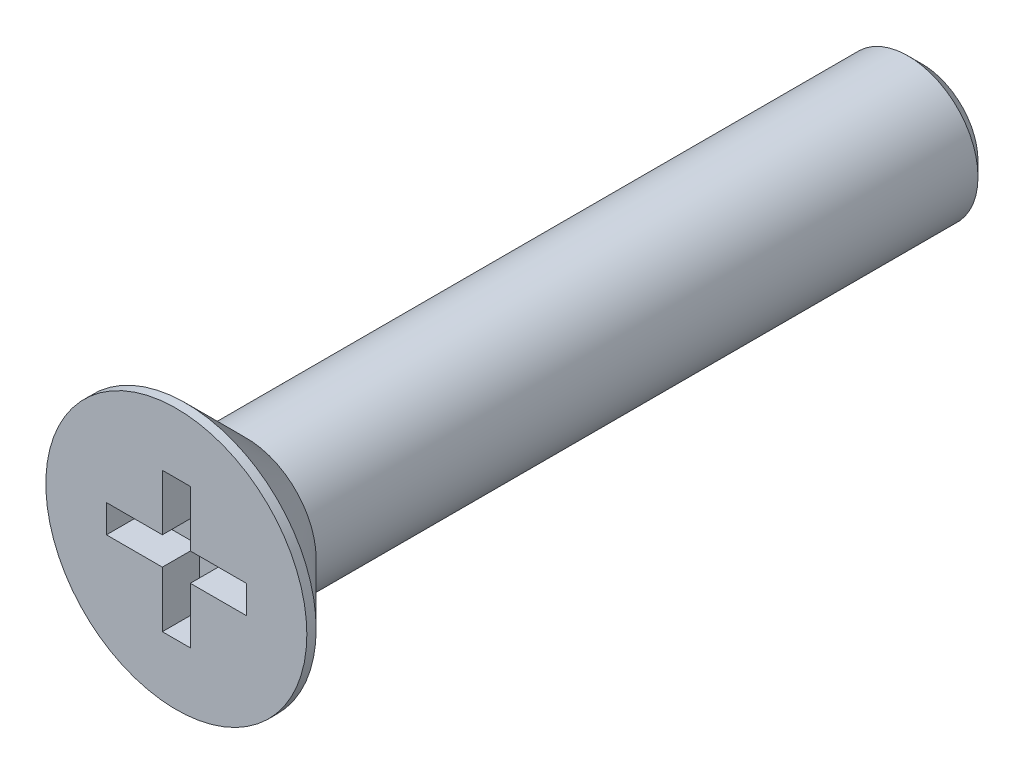
ISO-10303-21;
HEADER;
FILE_DESCRIPTION(('STEP AP214'),'2;1');
FILE_NAME('part.step','',(''),(''),'','','');
FILE_SCHEMA(('AUTOMOTIVE_DESIGN { 1 0 10303 214 1 1 1 1 }'));
ENDSEC;
DATA;
#1=APPLICATION_CONTEXT('core data for automotive mechanical design processes');
#2=APPLICATION_PROTOCOL_DEFINITION('international standard','automotive_design',2000,#1);
#3=PRODUCT_CONTEXT('',#1,'mechanical');
#4=PRODUCT('Part','Part','',(#3));
#5=PRODUCT_RELATED_PRODUCT_CATEGORY('part','',(#4));
#6=PRODUCT_DEFINITION_FORMATION('','',#4);
#7=PRODUCT_DEFINITION_CONTEXT('part definition',#1,'design');
#8=PRODUCT_DEFINITION('design','',#6,#7);
#9=PRODUCT_DEFINITION_SHAPE('','',#8);
#10=(LENGTH_UNIT() NAMED_UNIT(*) SI_UNIT(.MILLI.,.METRE.));
#11=(NAMED_UNIT(*) PLANE_ANGLE_UNIT() SI_UNIT($,.RADIAN.));
#12=(NAMED_UNIT(*) SI_UNIT($,.STERADIAN.) SOLID_ANGLE_UNIT());
#13=UNCERTAINTY_MEASURE_WITH_UNIT(LENGTH_MEASURE(1.E-05),#10,'distance_accuracy_value','');
#14=(GEOMETRIC_REPRESENTATION_CONTEXT(3) GLOBAL_UNCERTAINTY_ASSIGNED_CONTEXT((#13)) GLOBAL_UNIT_ASSIGNED_CONTEXT((#10,
#11,#12)) REPRESENTATION_CONTEXT('',''));
#15=CARTESIAN_POINT('',(0.,0.,0.));
#16=DIRECTION('',(0.,0.,1.));
#17=DIRECTION('',(1.,0.,0.));
#18=AXIS2_PLACEMENT_3D('',#15,#16,#17);
#19=CARTESIAN_POINT('',(0.,0.,0.));
#20=DIRECTION('',(0.,0.,-1.));
#21=DIRECTION('',(-1.,0.,0.));
#22=AXIS2_PLACEMENT_3D('',#19,#20,#21);
#23=PLANE('',#22);
#24=DIRECTION('',(0.,-1.,0.));
#25=VECTOR('',#24,1.);
#26=CARTESIAN_POINT('',(-1.5,-0.3,0.));
#27=LINE('',#26,#25);
#28=CARTESIAN_POINT('',(-1.5,0.3,0.));
#29=VERTEX_POINT('',#28);
#30=CARTESIAN_POINT('',(-1.5,-0.3,0.));
#31=VERTEX_POINT('',#30);
#32=EDGE_CURVE('E161',#29,#31,#27,.T.);
#33=ORIENTED_EDGE('',*,*,#32,.F.);
#34=DIRECTION('',(-1.,0.,0.));
#35=VECTOR('',#34,1.);
#36=CARTESIAN_POINT('',(-1.5,0.3,0.));
#37=LINE('',#36,#35);
#38=CARTESIAN_POINT('',(-0.3,0.3,0.));
#39=VERTEX_POINT('',#38);
#40=EDGE_CURVE('E51',#39,#29,#37,.T.);
#41=ORIENTED_EDGE('',*,*,#40,.F.);
#42=DIRECTION('',(0.,-1.,0.));
#43=VECTOR('',#42,1.);
#44=CARTESIAN_POINT('',(-0.3,0.3,0.));
#45=LINE('',#44,#43);
#46=CARTESIAN_POINT('',(-0.3,1.5,0.));
#47=VERTEX_POINT('',#46);
#48=EDGE_CURVE('E188',#47,#39,#45,.T.);
#49=ORIENTED_EDGE('',*,*,#48,.F.);
#50=DIRECTION('',(-1.,0.,0.));
#51=VECTOR('',#50,1.);
#52=CARTESIAN_POINT('',(-0.3,1.5,0.));
#53=LINE('',#52,#51);
#54=CARTESIAN_POINT('',(0.3,1.5,0.));
#55=VERTEX_POINT('',#54);
#56=EDGE_CURVE('E186',#55,#47,#53,.T.);
#57=ORIENTED_EDGE('',*,*,#56,.F.);
#58=DIRECTION('',(0.,1.,0.));
#59=VECTOR('',#58,1.);
#60=CARTESIAN_POINT('',(0.3,0.3,0.));
#61=LINE('',#60,#59);
#62=CARTESIAN_POINT('',(0.3,0.3,0.));
#63=VERTEX_POINT('',#62);
#64=EDGE_CURVE('E135',#63,#55,#61,.T.);
#65=ORIENTED_EDGE('',*,*,#64,.F.);
#66=DIRECTION('',(-1.,0.,0.));
#67=VECTOR('',#66,1.);
#68=CARTESIAN_POINT('',(1.5,0.3,0.));
#69=LINE('',#68,#67);
#70=CARTESIAN_POINT('',(1.5,0.3,0.));
#71=VERTEX_POINT('',#70);
#72=EDGE_CURVE('E182',#71,#63,#69,.T.);
#73=ORIENTED_EDGE('',*,*,#72,.F.);
#74=DIRECTION('',(0.,1.,0.));
#75=VECTOR('',#74,1.);
#76=CARTESIAN_POINT('',(1.5,-0.3,0.));
#77=LINE('',#76,#75);
#78=CARTESIAN_POINT('',(1.5,-0.3,0.));
#79=VERTEX_POINT('',#78);
#80=EDGE_CURVE('E179',#79,#71,#77,.T.);
#81=ORIENTED_EDGE('',*,*,#80,.F.);
#82=DIRECTION('',(1.,0.,0.));
#83=VECTOR('',#82,1.);
#84=CARTESIAN_POINT('',(1.5,-0.3,0.));
#85=LINE('',#84,#83);
#86=CARTESIAN_POINT('',(0.3,-0.3,0.));
#87=VERTEX_POINT('',#86);
#88=EDGE_CURVE('E176',#87,#79,#85,.T.);
#89=ORIENTED_EDGE('',*,*,#88,.F.);
#90=DIRECTION('',(0.,1.,0.));
#91=VECTOR('',#90,1.);
#92=CARTESIAN_POINT('',(0.3,-0.3,0.));
#93=LINE('',#92,#91);
#94=CARTESIAN_POINT('',(0.3,-1.5,0.));
#95=VERTEX_POINT('',#94);
#96=EDGE_CURVE('E173',#95,#87,#93,.T.);
#97=ORIENTED_EDGE('',*,*,#96,.F.);
#98=DIRECTION('',(1.,0.,0.));
#99=VECTOR('',#98,1.);
#100=CARTESIAN_POINT('',(-0.299999999999999,-1.5,0.));
#101=LINE('',#100,#99);
#102=CARTESIAN_POINT('',(-0.299999999999999,-1.5,0.));
#103=VERTEX_POINT('',#102);
#104=EDGE_CURVE('E170',#103,#95,#101,.T.);
#105=ORIENTED_EDGE('',*,*,#104,.F.);
#106=DIRECTION('',(0.,-1.,0.));
#107=VECTOR('',#106,1.);
#108=CARTESIAN_POINT('',(-0.3,-0.3,0.));
#109=LINE('',#108,#107);
#110=CARTESIAN_POINT('',(-0.3,-0.3,0.));
#111=VERTEX_POINT('',#110);
#112=EDGE_CURVE('E167',#111,#103,#109,.T.);
#113=ORIENTED_EDGE('',*,*,#112,.F.);
#114=DIRECTION('',(1.,0.,0.));
#115=VECTOR('',#114,1.);
#116=CARTESIAN_POINT('',(-1.5,-0.3,0.));
#117=LINE('',#116,#115);
#118=EDGE_CURVE('E164',#31,#111,#117,.T.);
#119=ORIENTED_EDGE('',*,*,#118,.F.);
#120=EDGE_LOOP('',(#33,#41,#49,#57,#65,#73,#81,#89,#97,#105,#113,#119));
#121=FACE_BOUND('',#120,.T.);
#122=CARTESIAN_POINT('',(0.,0.,0.));
#123=DIRECTION('',(0.,0.,1.));
#124=DIRECTION('',(1.,0.,0.));
#125=AXIS2_PLACEMENT_3D('',#122,#123,#124);
#126=CIRCLE('',#125,2.8);
#127=CARTESIAN_POINT('',(2.8,0.,0.));
#128=VERTEX_POINT('',#127);
#129=EDGE_CURVE('E215',#128,#128,#126,.T.);
#130=ORIENTED_EDGE('',*,*,#129,.T.);
#131=EDGE_LOOP('',(#130));
#132=FACE_BOUND('',#131,.T.);
#133=ADVANCED_FACE('F36',(#121,#132),#23,.F.);
#134=CARTESIAN_POINT('',(0.,0.,31.7635815070186));
#135=DIRECTION('',(0.,0.,1.));
#136=DIRECTION('',(1.,0.,0.));
#137=AXIS2_PLACEMENT_3D('',#134,#135,#136);
#138=CYLINDRICAL_SURFACE('',#137,2.8);
#139=ORIENTED_EDGE('',*,*,#129,.F.);
#140=EDGE_LOOP('',(#139));
#141=FACE_BOUND('',#140,.T.);
#142=CARTESIAN_POINT('',(0.,0.,-0.200000000000006));
#143=DIRECTION('',(0.,0.,1.));
#144=DIRECTION('',(1.,0.,0.));
#145=AXIS2_PLACEMENT_3D('',#142,#143,#144);
#146=CIRCLE('',#145,2.8);
#147=CARTESIAN_POINT('',(2.8,0.,-0.200000000000006));
#148=VERTEX_POINT('',#147);
#149=EDGE_CURVE('E212',#148,#148,#146,.T.);
#150=ORIENTED_EDGE('',*,*,#149,.T.);
#151=EDGE_LOOP('',(#150));
#152=FACE_BOUND('',#151,.T.);
#153=ADVANCED_FACE('F232',(#141,#152),#138,.T.);
#154=CARTESIAN_POINT('',(0.,0.,-1.5));
#155=DIRECTION('',(0.,0.,1.));
#156=DIRECTION('',(1.,0.,0.));
#157=AXIS2_PLACEMENT_3D('',#154,#155,#156);
#158=CONICAL_SURFACE('',#157,1.5,0.78539816339745);
#159=ORIENTED_EDGE('',*,*,#149,.F.);
#160=EDGE_LOOP('',(#159));
#161=FACE_BOUND('',#160,.T.);
#162=CARTESIAN_POINT('',(0.,0.,-1.5));
#163=DIRECTION('',(0.,0.,1.));
#164=DIRECTION('',(1.,0.,0.));
#165=AXIS2_PLACEMENT_3D('',#162,#163,#164);
#166=CIRCLE('',#165,1.5);
#167=CARTESIAN_POINT('',(1.5,0.,-1.5));
#168=VERTEX_POINT('',#167);
#169=EDGE_CURVE('E192',#168,#168,#166,.T.);
#170=ORIENTED_EDGE('',*,*,#169,.T.);
#171=EDGE_LOOP('',(#170));
#172=FACE_BOUND('',#171,.T.);
#173=ADVANCED_FACE('F237',(#161,#172),#158,.T.);
#174=CARTESIAN_POINT('',(0.,0.,31.7635815070186));
#175=DIRECTION('',(0.,0.,1.));
#176=DIRECTION('',(1.,0.,0.));
#177=AXIS2_PLACEMENT_3D('',#174,#175,#176);
#178=CYLINDRICAL_SURFACE('',#177,1.5);
#179=CARTESIAN_POINT('',(0.,0.,-15.7));
#180=DIRECTION('',(0.,0.,1.));
#181=DIRECTION('',(1.,0.,0.));
#182=AXIS2_PLACEMENT_3D('',#179,#180,#181);
#183=CIRCLE('',#182,1.5);
#184=CARTESIAN_POINT('',(1.5,0.,-15.7));
#185=VERTEX_POINT('',#184);
#186=EDGE_CURVE('E44',#185,#185,#183,.T.);
#187=ORIENTED_EDGE('',*,*,#186,.T.);
#188=EDGE_LOOP('',(#187));
#189=FACE_BOUND('',#188,.T.);
#190=ORIENTED_EDGE('',*,*,#169,.F.);
#191=EDGE_LOOP('',(#190));
#192=FACE_BOUND('',#191,.T.);
#193=ADVANCED_FACE('F220',(#189,#192),#178,.T.);
#194=CARTESIAN_POINT('',(0.,1.5,-16.));
#195=DIRECTION('',(0.,0.,1.));
#196=DIRECTION('',(1.,0.,0.));
#197=AXIS2_PLACEMENT_3D('',#194,#195,#196);
#198=PLANE('',#197);
#199=CARTESIAN_POINT('',(0.,0.,-16.));
#200=DIRECTION('',(0.,0.,1.));
#201=DIRECTION('',(1.,0.,0.));
#202=AXIS2_PLACEMENT_3D('',#199,#200,#201);
#203=CIRCLE('',#202,1.2);
#204=CARTESIAN_POINT('',(1.2,0.,-16.));
#205=VERTEX_POINT('',#204);
#206=EDGE_CURVE('E11',#205,#205,#203,.F.);
#207=ORIENTED_EDGE('',*,*,#206,.T.);
#208=EDGE_LOOP('',(#207));
#209=FACE_BOUND('',#208,.T.);
#210=ADVANCED_FACE('F248',(#209),#198,.F.);
#211=CARTESIAN_POINT('',(-1.5,0.3,-0.8));
#212=DIRECTION('',(0.,1.,0.));
#213=DIRECTION('',(-1.,0.,0.));
#214=AXIS2_PLACEMENT_3D('',#211,#212,#213);
#215=PLANE('',#214);
#216=ORIENTED_EDGE('',*,*,#40,.T.);
#217=DIRECTION('',(0.,0.,1.));
#218=VECTOR('',#217,1.);
#219=CARTESIAN_POINT('',(-1.5,0.3,-0.8));
#220=LINE('',#219,#218);
#221=CARTESIAN_POINT('',(-1.5,0.3,-0.8));
#222=VERTEX_POINT('',#221);
#223=EDGE_CURVE('E99',#222,#29,#220,.T.);
#224=ORIENTED_EDGE('',*,*,#223,.F.);
#225=DIRECTION('',(-1.,0.,0.));
#226=VECTOR('',#225,1.);
#227=CARTESIAN_POINT('',(-1.5,0.3,-0.8));
#228=LINE('',#227,#226);
#229=CARTESIAN_POINT('',(-0.3,0.3,-0.8));
#230=VERTEX_POINT('',#229);
#231=EDGE_CURVE('E190',#230,#222,#228,.T.);
#232=ORIENTED_EDGE('',*,*,#231,.F.);
#233=DIRECTION('',(0.,0.,1.));
#234=VECTOR('',#233,1.);
#235=CARTESIAN_POINT('',(-0.3,0.3,-0.8));
#236=LINE('',#235,#234);
#237=EDGE_CURVE('E59',#230,#39,#236,.T.);
#238=ORIENTED_EDGE('',*,*,#237,.T.);
#239=EDGE_LOOP('',(#216,#224,#232,#238));
#240=FACE_BOUND('',#239,.T.);
#241=ADVANCED_FACE('F251',(#240),#215,.F.);
#242=CARTESIAN_POINT('',(-0.3,0.3,-0.8));
#243=DIRECTION('',(-1.,0.,0.));
#244=DIRECTION('',(0.,-1.,0.));
#245=AXIS2_PLACEMENT_3D('',#242,#243,#244);
#246=PLANE('',#245);
#247=ORIENTED_EDGE('',*,*,#48,.T.);
#248=ORIENTED_EDGE('',*,*,#237,.F.);
#249=DIRECTION('',(0.,-1.,0.));
#250=VECTOR('',#249,1.);
#251=CARTESIAN_POINT('',(-0.3,0.3,-0.8));
#252=LINE('',#251,#250);
#253=CARTESIAN_POINT('',(-0.3,1.5,-0.8));
#254=VERTEX_POINT('',#253);
#255=EDGE_CURVE('E147',#254,#230,#252,.T.);
#256=ORIENTED_EDGE('',*,*,#255,.F.);
#257=DIRECTION('',(0.,0.,1.));
#258=VECTOR('',#257,1.);
#259=CARTESIAN_POINT('',(-0.3,1.5,-0.8));
#260=LINE('',#259,#258);
#261=EDGE_CURVE('E139',#254,#47,#260,.T.);
#262=ORIENTED_EDGE('',*,*,#261,.T.);
#263=EDGE_LOOP('',(#247,#248,#256,#262));
#264=FACE_BOUND('',#263,.T.);
#265=ADVANCED_FACE('F255',(#264),#246,.F.);
#266=CARTESIAN_POINT('',(-0.3,1.5,-0.8));
#267=DIRECTION('',(0.,1.,0.));
#268=DIRECTION('',(0.,0.,1.));
#269=AXIS2_PLACEMENT_3D('',#266,#267,#268);
#270=PLANE('',#269);
#271=ORIENTED_EDGE('',*,*,#56,.T.);
#272=ORIENTED_EDGE('',*,*,#261,.F.);
#273=DIRECTION('',(-1.,0.,0.));
#274=VECTOR('',#273,1.);
#275=CARTESIAN_POINT('',(-0.3,1.5,-0.8));
#276=LINE('',#275,#274);
#277=CARTESIAN_POINT('',(0.3,1.5,-0.8));
#278=VERTEX_POINT('',#277);
#279=EDGE_CURVE('E143',#278,#254,#276,.T.);
#280=ORIENTED_EDGE('',*,*,#279,.F.);
#281=DIRECTION('',(0.,0.,1.));
#282=VECTOR('',#281,1.);
#283=CARTESIAN_POINT('',(0.3,1.5,-0.8));
#284=LINE('',#283,#282);
#285=EDGE_CURVE('E128',#278,#55,#284,.T.);
#286=ORIENTED_EDGE('',*,*,#285,.T.);
#287=EDGE_LOOP('',(#271,#272,#280,#286));
#288=FACE_BOUND('',#287,.T.);
#289=ADVANCED_FACE('F144',(#288),#270,.F.);
#290=CARTESIAN_POINT('',(0.3,0.3,-0.8));
#291=DIRECTION('',(1.,0.,0.));
#292=DIRECTION('',(0.,1.,0.));
#293=AXIS2_PLACEMENT_3D('',#290,#291,#292);
#294=PLANE('',#293);
#295=ORIENTED_EDGE('',*,*,#64,.T.);
#296=ORIENTED_EDGE('',*,*,#285,.F.);
#297=DIRECTION('',(0.,1.,0.));
#298=VECTOR('',#297,1.);
#299=CARTESIAN_POINT('',(0.3,0.3,-0.8));
#300=LINE('',#299,#298);
#301=CARTESIAN_POINT('',(0.3,0.3,-0.8));
#302=VERTEX_POINT('',#301);
#303=EDGE_CURVE('E132',#302,#278,#300,.T.);
#304=ORIENTED_EDGE('',*,*,#303,.F.);
#305=DIRECTION('',(0.,0.,1.));
#306=VECTOR('',#305,1.);
#307=CARTESIAN_POINT('',(0.3,0.3,-0.8));
#308=LINE('',#307,#306);
#309=EDGE_CURVE('E140',#302,#63,#308,.T.);
#310=ORIENTED_EDGE('',*,*,#309,.T.);
#311=EDGE_LOOP('',(#295,#296,#304,#310));
#312=FACE_BOUND('',#311,.T.);
#313=ADVANCED_FACE('F130',(#312),#294,.F.);
#314=CARTESIAN_POINT('',(1.5,0.3,-0.8));
#315=DIRECTION('',(0.,1.,0.));
#316=DIRECTION('',(-1.,0.,0.));
#317=AXIS2_PLACEMENT_3D('',#314,#315,#316);
#318=PLANE('',#317);
#319=ORIENTED_EDGE('',*,*,#72,.T.);
#320=ORIENTED_EDGE('',*,*,#309,.F.);
#321=DIRECTION('',(-1.,0.,0.));
#322=VECTOR('',#321,1.);
#323=CARTESIAN_POINT('',(1.5,0.3,-0.8));
#324=LINE('',#323,#322);
#325=CARTESIAN_POINT('',(1.5,0.3,-0.8));
#326=VERTEX_POINT('',#325);
#327=EDGE_CURVE('E153',#326,#302,#324,.T.);
#328=ORIENTED_EDGE('',*,*,#327,.F.);
#329=DIRECTION('',(0.,0.,1.));
#330=VECTOR('',#329,1.);
#331=CARTESIAN_POINT('',(1.5,0.3,-0.8));
#332=LINE('',#331,#330);
#333=EDGE_CURVE('E195',#326,#71,#332,.T.);
#334=ORIENTED_EDGE('',*,*,#333,.T.);
#335=EDGE_LOOP('',(#319,#320,#328,#334));
#336=FACE_BOUND('',#335,.T.);
#337=ADVANCED_FACE('F282',(#336),#318,.F.);
#338=CARTESIAN_POINT('',(1.5,-0.3,-0.8));
#339=DIRECTION('',(1.,0.,0.));
#340=DIRECTION('',(0.,0.,-1.));
#341=AXIS2_PLACEMENT_3D('',#338,#339,#340);
#342=PLANE('',#341);
#343=ORIENTED_EDGE('',*,*,#80,.T.);
#344=ORIENTED_EDGE('',*,*,#333,.F.);
#345=DIRECTION('',(0.,1.,0.));
#346=VECTOR('',#345,1.);
#347=CARTESIAN_POINT('',(1.5,-0.3,-0.8));
#348=LINE('',#347,#346);
#349=CARTESIAN_POINT('',(1.5,-0.3,-0.8));
#350=VERTEX_POINT('',#349);
#351=EDGE_CURVE('E155',#350,#326,#348,.T.);
#352=ORIENTED_EDGE('',*,*,#351,.F.);
#353=DIRECTION('',(0.,0.,1.));
#354=VECTOR('',#353,1.);
#355=CARTESIAN_POINT('',(1.5,-0.3,-0.8));
#356=LINE('',#355,#354);
#357=EDGE_CURVE('E197',#350,#79,#356,.T.);
#358=ORIENTED_EDGE('',*,*,#357,.T.);
#359=EDGE_LOOP('',(#343,#344,#352,#358));
#360=FACE_BOUND('',#359,.T.);
#361=ADVANCED_FACE('F278',(#360),#342,.F.);
#362=CARTESIAN_POINT('',(1.5,-0.3,-0.8));
#363=DIRECTION('',(0.,-1.,0.));
#364=DIRECTION('',(1.,0.,0.));
#365=AXIS2_PLACEMENT_3D('',#362,#363,#364);
#366=PLANE('',#365);
#367=ORIENTED_EDGE('',*,*,#88,.T.);
#368=ORIENTED_EDGE('',*,*,#357,.F.);
#369=DIRECTION('',(1.,0.,0.));
#370=VECTOR('',#369,1.);
#371=CARTESIAN_POINT('',(1.5,-0.3,-0.8));
#372=LINE('',#371,#370);
#373=CARTESIAN_POINT('',(0.3,-0.3,-0.8));
#374=VERTEX_POINT('',#373);
#375=EDGE_CURVE('E315',#374,#350,#372,.T.);
#376=ORIENTED_EDGE('',*,*,#375,.F.);
#377=DIRECTION('',(0.,0.,1.));
#378=VECTOR('',#377,1.);
#379=CARTESIAN_POINT('',(0.3,-0.3,-0.8));
#380=LINE('',#379,#378);
#381=EDGE_CURVE('E199',#374,#87,#380,.T.);
#382=ORIENTED_EDGE('',*,*,#381,.T.);
#383=EDGE_LOOP('',(#367,#368,#376,#382));
#384=FACE_BOUND('',#383,.T.);
#385=ADVANCED_FACE('F274',(#384),#366,.F.);
#386=CARTESIAN_POINT('',(0.3,-0.3,-0.8));
#387=DIRECTION('',(1.,0.,0.));
#388=DIRECTION('',(0.,1.,0.));
#389=AXIS2_PLACEMENT_3D('',#386,#387,#388);
#390=PLANE('',#389);
#391=ORIENTED_EDGE('',*,*,#96,.T.);
#392=ORIENTED_EDGE('',*,*,#381,.F.);
#393=DIRECTION('',(0.,1.,0.));
#394=VECTOR('',#393,1.);
#395=CARTESIAN_POINT('',(0.3,-0.3,-0.8));
#396=LINE('',#395,#394);
#397=CARTESIAN_POINT('',(0.3,-1.5,-0.8));
#398=VERTEX_POINT('',#397);
#399=EDGE_CURVE('E312',#398,#374,#396,.T.);
#400=ORIENTED_EDGE('',*,*,#399,.F.);
#401=DIRECTION('',(0.,0.,1.));
#402=VECTOR('',#401,1.);
#403=CARTESIAN_POINT('',(0.3,-1.5,-0.8));
#404=LINE('',#403,#402);
#405=EDGE_CURVE('E201',#398,#95,#404,.T.);
#406=ORIENTED_EDGE('',*,*,#405,.T.);
#407=EDGE_LOOP('',(#391,#392,#400,#406));
#408=FACE_BOUND('',#407,.T.);
#409=ADVANCED_FACE('F270',(#408),#390,.F.);
#410=CARTESIAN_POINT('',(-0.299999999999999,-1.5,-0.8));
#411=DIRECTION('',(0.,-1.,0.));
#412=DIRECTION('',(0.,0.,-1.));
#413=AXIS2_PLACEMENT_3D('',#410,#411,#412);
#414=PLANE('',#413);
#415=ORIENTED_EDGE('',*,*,#104,.T.);
#416=ORIENTED_EDGE('',*,*,#405,.F.);
#417=DIRECTION('',(1.,0.,0.));
#418=VECTOR('',#417,1.);
#419=CARTESIAN_POINT('',(-0.299999999999999,-1.5,-0.8));
#420=LINE('',#419,#418);
#421=CARTESIAN_POINT('',(-0.299999999999999,-1.5,-0.8));
#422=VERTEX_POINT('',#421);
#423=EDGE_CURVE('E309',#422,#398,#420,.T.);
#424=ORIENTED_EDGE('',*,*,#423,.F.);
#425=DIRECTION('',(0.,0.,1.));
#426=VECTOR('',#425,1.);
#427=CARTESIAN_POINT('',(-0.299999999999999,-1.5,-0.8));
#428=LINE('',#427,#426);
#429=EDGE_CURVE('E203',#422,#103,#428,.T.);
#430=ORIENTED_EDGE('',*,*,#429,.T.);
#431=EDGE_LOOP('',(#415,#416,#424,#430));
#432=FACE_BOUND('',#431,.T.);
#433=ADVANCED_FACE('F266',(#432),#414,.F.);
#434=CARTESIAN_POINT('',(-0.3,-0.3,-0.8));
#435=DIRECTION('',(-1.,0.,0.));
#436=DIRECTION('',(0.,-1.,0.));
#437=AXIS2_PLACEMENT_3D('',#434,#435,#436);
#438=PLANE('',#437);
#439=ORIENTED_EDGE('',*,*,#112,.T.);
#440=ORIENTED_EDGE('',*,*,#429,.F.);
#441=DIRECTION('',(0.,-1.,0.));
#442=VECTOR('',#441,1.);
#443=CARTESIAN_POINT('',(-0.3,-0.3,-0.8));
#444=LINE('',#443,#442);
#445=CARTESIAN_POINT('',(-0.3,-0.3,-0.8));
#446=VERTEX_POINT('',#445);
#447=EDGE_CURVE('E306',#446,#422,#444,.T.);
#448=ORIENTED_EDGE('',*,*,#447,.F.);
#449=DIRECTION('',(0.,0.,1.));
#450=VECTOR('',#449,1.);
#451=CARTESIAN_POINT('',(-0.3,-0.3,-0.8));
#452=LINE('',#451,#450);
#453=EDGE_CURVE('E205',#446,#111,#452,.T.);
#454=ORIENTED_EDGE('',*,*,#453,.T.);
#455=EDGE_LOOP('',(#439,#440,#448,#454));
#456=FACE_BOUND('',#455,.T.);
#457=ADVANCED_FACE('F262',(#456),#438,.F.);
#458=CARTESIAN_POINT('',(-1.5,-0.3,-0.8));
#459=DIRECTION('',(0.,-1.,0.));
#460=DIRECTION('',(1.,0.,0.));
#461=AXIS2_PLACEMENT_3D('',#458,#459,#460);
#462=PLANE('',#461);
#463=ORIENTED_EDGE('',*,*,#118,.T.);
#464=ORIENTED_EDGE('',*,*,#453,.F.);
#465=DIRECTION('',(1.,0.,0.));
#466=VECTOR('',#465,1.);
#467=CARTESIAN_POINT('',(-1.5,-0.3,-0.8));
#468=LINE('',#467,#466);
#469=CARTESIAN_POINT('',(-1.5,-0.3,-0.8));
#470=VERTEX_POINT('',#469);
#471=EDGE_CURVE('E301',#470,#446,#468,.T.);
#472=ORIENTED_EDGE('',*,*,#471,.F.);
#473=DIRECTION('',(0.,0.,1.));
#474=VECTOR('',#473,1.);
#475=CARTESIAN_POINT('',(-1.5,-0.3,-0.8));
#476=LINE('',#475,#474);
#477=EDGE_CURVE('E207',#470,#31,#476,.T.);
#478=ORIENTED_EDGE('',*,*,#477,.T.);
#479=EDGE_LOOP('',(#463,#464,#472,#478));
#480=FACE_BOUND('',#479,.T.);
#481=ADVANCED_FACE('F258',(#480),#462,.F.);
#482=CARTESIAN_POINT('',(-1.5,-0.3,-0.8));
#483=DIRECTION('',(-1.,0.,0.));
#484=DIRECTION('',(0.,-1.,0.));
#485=AXIS2_PLACEMENT_3D('',#482,#483,#484);
#486=PLANE('',#485);
#487=ORIENTED_EDGE('',*,*,#32,.T.);
#488=ORIENTED_EDGE('',*,*,#477,.F.);
#489=DIRECTION('',(0.,-1.,0.));
#490=VECTOR('',#489,1.);
#491=CARTESIAN_POINT('',(-1.5,-0.3,-0.8));
#492=LINE('',#491,#490);
#493=EDGE_CURVE('E299',#222,#470,#492,.T.);
#494=ORIENTED_EDGE('',*,*,#493,.F.);
#495=ORIENTED_EDGE('',*,*,#223,.T.);
#496=EDGE_LOOP('',(#487,#488,#494,#495));
#497=FACE_BOUND('',#496,.T.);
#498=ADVANCED_FACE('F228',(#497),#486,.F.);
#499=CARTESIAN_POINT('',(0.,0.,-0.8));
#500=DIRECTION('',(0.,0.,1.));
#501=DIRECTION('',(1.,0.,0.));
#502=AXIS2_PLACEMENT_3D('',#499,#500,#501);
#503=PLANE('',#502);
#504=ORIENTED_EDGE('',*,*,#231,.T.);
#505=ORIENTED_EDGE('',*,*,#493,.T.);
#506=ORIENTED_EDGE('',*,*,#471,.T.);
#507=ORIENTED_EDGE('',*,*,#447,.T.);
#508=ORIENTED_EDGE('',*,*,#423,.T.);
#509=ORIENTED_EDGE('',*,*,#399,.T.);
#510=ORIENTED_EDGE('',*,*,#375,.T.);
#511=ORIENTED_EDGE('',*,*,#351,.T.);
#512=ORIENTED_EDGE('',*,*,#327,.T.);
#513=ORIENTED_EDGE('',*,*,#303,.T.);
#514=ORIENTED_EDGE('',*,*,#279,.T.);
#515=ORIENTED_EDGE('',*,*,#255,.T.);
#516=EDGE_LOOP('',(#504,#505,#506,#507,#508,#509,#510,#511,#512,#513,#514,#515));
#517=FACE_BOUND('',#516,.T.);
#518=ADVANCED_FACE('F150',(#517),#503,.T.);
#519=CARTESIAN_POINT('',(0.,0.,-15.7));
#520=DIRECTION('',(0.,0.,1.));
#521=DIRECTION('',(1.,0.,0.));
#522=AXIS2_PLACEMENT_3D('',#519,#520,#521);
#523=CONICAL_SURFACE('',#522,1.5,0.785398163397459);
#524=ORIENTED_EDGE('',*,*,#206,.F.);
#525=EDGE_LOOP('',(#524));
#526=FACE_BOUND('',#525,.T.);
#527=ORIENTED_EDGE('',*,*,#186,.F.);
#528=EDGE_LOOP('',(#527));
#529=FACE_BOUND('',#528,.T.);
#530=ADVANCED_FACE('F38',(#526,#529),#523,.T.);
#531=CLOSED_SHELL('',(#133,#153,#173,#193,#210,#241,#265,#289,#313,#337,#361,#385,#409,#433,
#457,#481,#498,#518,#530));
#532=MANIFOLD_SOLID_BREP('B2',#531);
#533=ADVANCED_BREP_SHAPE_REPRESENTATION('',(#18,#532),#14);
#534=SHAPE_DEFINITION_REPRESENTATION(#9,#533);
ENDSEC;
END-ISO-10303-21;
